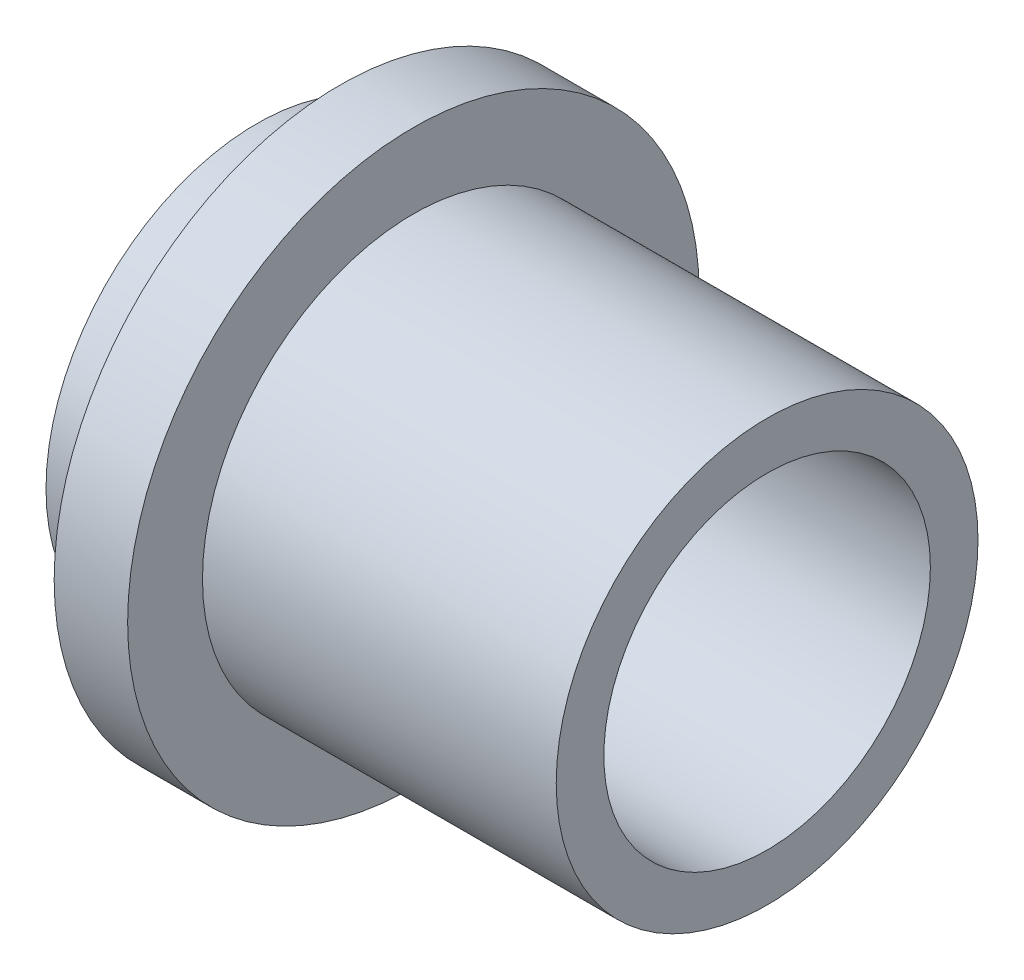
ISO-10303-21;
HEADER;
FILE_DESCRIPTION(('STEP AP214'),'2;1');
FILE_NAME('part.step','',(''),(''),'','','');
FILE_SCHEMA(('AUTOMOTIVE_DESIGN { 1 0 10303 214 1 1 1 1 }'));
ENDSEC;
DATA;
#1=APPLICATION_CONTEXT('core data for automotive mechanical design processes');
#2=APPLICATION_PROTOCOL_DEFINITION('international standard','automotive_design',2000,#1);
#3=PRODUCT_CONTEXT('',#1,'mechanical');
#4=PRODUCT('Part','Part','',(#3));
#5=PRODUCT_RELATED_PRODUCT_CATEGORY('part','',(#4));
#6=PRODUCT_DEFINITION_FORMATION('','',#4);
#7=PRODUCT_DEFINITION_CONTEXT('part definition',#1,'design');
#8=PRODUCT_DEFINITION('design','',#6,#7);
#9=PRODUCT_DEFINITION_SHAPE('','',#8);
#10=(LENGTH_UNIT() NAMED_UNIT(*) SI_UNIT(.MILLI.,.METRE.));
#11=(NAMED_UNIT(*) PLANE_ANGLE_UNIT() SI_UNIT($,.RADIAN.));
#12=(NAMED_UNIT(*) SI_UNIT($,.STERADIAN.) SOLID_ANGLE_UNIT());
#13=UNCERTAINTY_MEASURE_WITH_UNIT(LENGTH_MEASURE(1.E-05),#10,'distance_accuracy_value','');
#14=(GEOMETRIC_REPRESENTATION_CONTEXT(3) GLOBAL_UNCERTAINTY_ASSIGNED_CONTEXT((#13)) GLOBAL_UNIT_ASSIGNED_CONTEXT((#10,
#11,#12)) REPRESENTATION_CONTEXT('',''));
#15=CARTESIAN_POINT('',(0.,0.,0.));
#16=DIRECTION('',(0.,0.,1.));
#17=DIRECTION('',(1.,0.,0.));
#18=AXIS2_PLACEMENT_3D('',#15,#16,#17);
#19=CARTESIAN_POINT('',(9.525,3.937,0.));
#20=DIRECTION('',(-1.,0.,0.));
#21=DIRECTION('',(0.,0.,1.));
#22=AXIS2_PLACEMENT_3D('',#19,#20,#21);
#23=PLANE('',#22);
#24=CARTESIAN_POINT('',(9.525,0.,0.));
#25=DIRECTION('',(-1.,0.,0.));
#26=DIRECTION('',(0.,0.,1.));
#27=AXIS2_PLACEMENT_3D('',#24,#25,#26);
#28=CIRCLE('',#27,3.937);
#29=CARTESIAN_POINT('',(9.525,0.,3.937));
#30=VERTEX_POINT('',#29);
#31=EDGE_CURVE('E82',#30,#30,#28,.T.);
#32=ORIENTED_EDGE('',*,*,#31,.F.);
#33=EDGE_LOOP('',(#32));
#34=FACE_BOUND('',#33,.T.);
#35=CARTESIAN_POINT('',(9.525,0.,0.));
#36=DIRECTION('',(1.,0.,0.));
#37=DIRECTION('',(0.,0.,-1.));
#38=AXIS2_PLACEMENT_3D('',#35,#36,#37);
#39=CIRCLE('',#38,3.048);
#40=CARTESIAN_POINT('',(9.525,0.,-3.048));
#41=VERTEX_POINT('',#40);
#42=EDGE_CURVE('E90',#41,#41,#39,.T.);
#43=ORIENTED_EDGE('',*,*,#42,.F.);
#44=EDGE_LOOP('',(#43));
#45=FACE_BOUND('',#44,.T.);
#46=ADVANCED_FACE('F50',(#34,#45),#23,.F.);
#47=CARTESIAN_POINT('',(0.,0.,0.));
#48=DIRECTION('',(1.,0.,0.));
#49=DIRECTION('',(0.,0.,-1.));
#50=AXIS2_PLACEMENT_3D('',#47,#48,#49);
#51=PLANE('',#50);
#52=CARTESIAN_POINT('',(0.,0.,0.));
#53=DIRECTION('',(1.,0.,0.));
#54=DIRECTION('',(0.,0.,-1.));
#55=AXIS2_PLACEMENT_3D('',#52,#53,#54);
#56=CIRCLE('',#55,3.048);
#57=CARTESIAN_POINT('',(0.,0.,-3.048));
#58=VERTEX_POINT('',#57);
#59=EDGE_CURVE('E86',#58,#58,#56,.T.);
#60=ORIENTED_EDGE('',*,*,#59,.T.);
#61=EDGE_LOOP('',(#60));
#62=FACE_BOUND('',#61,.T.);
#63=CARTESIAN_POINT('',(0.,0.,0.));
#64=DIRECTION('',(-1.,0.,0.));
#65=DIRECTION('',(0.,0.,1.));
#66=AXIS2_PLACEMENT_3D('',#63,#64,#65);
#67=CIRCLE('',#66,3.937);
#68=CARTESIAN_POINT('',(0.,0.,3.937));
#69=VERTEX_POINT('',#68);
#70=EDGE_CURVE('E12',#69,#69,#67,.T.);
#71=ORIENTED_EDGE('',*,*,#70,.T.);
#72=EDGE_LOOP('',(#71));
#73=FACE_BOUND('',#72,.T.);
#74=ADVANCED_FACE('F52',(#62,#73),#51,.F.);
#75=CARTESIAN_POINT('',(-1.98792847682119,0.,0.));
#76=DIRECTION('',(-1.,0.,0.));
#77=DIRECTION('',(0.,0.,1.));
#78=AXIS2_PLACEMENT_3D('',#75,#76,#77);
#79=CYLINDRICAL_SURFACE('',#78,3.937);
#80=ORIENTED_EDGE('',*,*,#70,.F.);
#81=EDGE_LOOP('',(#80));
#82=FACE_BOUND('',#81,.T.);
#83=CARTESIAN_POINT('',(0.635,0.,0.));
#84=DIRECTION('',(-1.,0.,0.));
#85=DIRECTION('',(0.,0.,1.));
#86=AXIS2_PLACEMENT_3D('',#83,#84,#85);
#87=CIRCLE('',#86,3.937);
#88=CARTESIAN_POINT('',(0.635,0.,3.937));
#89=VERTEX_POINT('',#88);
#90=EDGE_CURVE('E58',#89,#89,#87,.T.);
#91=ORIENTED_EDGE('',*,*,#90,.T.);
#92=EDGE_LOOP('',(#91));
#93=FACE_BOUND('',#92,.T.);
#94=ADVANCED_FACE('F103',(#82,#93),#79,.T.);
#95=CARTESIAN_POINT('',(1.5494,0.,0.));
#96=DIRECTION('',(1.,0.,0.));
#97=DIRECTION('',(0.,0.,-1.));
#98=AXIS2_PLACEMENT_3D('',#95,#96,#97);
#99=CONICAL_SURFACE('',#98,4.8514,0.78539816339745);
#100=ORIENTED_EDGE('',*,*,#90,.F.);
#101=EDGE_LOOP('',(#100));
#102=FACE_BOUND('',#101,.T.);
#103=CARTESIAN_POINT('',(1.5494,0.,0.));
#104=DIRECTION('',(-1.,0.,0.));
#105=DIRECTION('',(0.,0.,1.));
#106=AXIS2_PLACEMENT_3D('',#103,#104,#105);
#107=CIRCLE('',#106,4.8514);
#108=CARTESIAN_POINT('',(1.5494,0.,4.8514));
#109=VERTEX_POINT('',#108);
#110=EDGE_CURVE('E63',#109,#109,#107,.T.);
#111=ORIENTED_EDGE('',*,*,#110,.T.);
#112=EDGE_LOOP('',(#111));
#113=FACE_BOUND('',#112,.T.);
#114=ADVANCED_FACE('F123',(#102,#113),#99,.T.);
#115=CARTESIAN_POINT('',(1.5494,4.8514,0.));
#116=DIRECTION('',(1.,0.,0.));
#117=DIRECTION('',(0.,0.,-1.));
#118=AXIS2_PLACEMENT_3D('',#115,#116,#117);
#119=PLANE('',#118);
#120=ORIENTED_EDGE('',*,*,#110,.F.);
#121=EDGE_LOOP('',(#120));
#122=FACE_BOUND('',#121,.T.);
#123=CARTESIAN_POINT('',(1.5494,0.,0.));
#124=DIRECTION('',(-1.,0.,0.));
#125=DIRECTION('',(0.,0.,1.));
#126=AXIS2_PLACEMENT_3D('',#123,#124,#125);
#127=CIRCLE('',#126,5.334);
#128=CARTESIAN_POINT('',(1.5494,0.,5.334));
#129=VERTEX_POINT('',#128);
#130=EDGE_CURVE('E68',#129,#129,#127,.T.);
#131=ORIENTED_EDGE('',*,*,#130,.T.);
#132=EDGE_LOOP('',(#131));
#133=FACE_BOUND('',#132,.T.);
#134=ADVANCED_FACE('F119',(#122,#133),#119,.F.);
#135=CARTESIAN_POINT('',(-1.98792847682119,0.,0.));
#136=DIRECTION('',(-1.,0.,0.));
#137=DIRECTION('',(0.,0.,1.));
#138=AXIS2_PLACEMENT_3D('',#135,#136,#137);
#139=CYLINDRICAL_SURFACE('',#138,5.334);
#140=ORIENTED_EDGE('',*,*,#130,.F.);
#141=EDGE_LOOP('',(#140));
#142=FACE_BOUND('',#141,.T.);
#143=CARTESIAN_POINT('',(2.921,0.,0.));
#144=DIRECTION('',(-1.,0.,0.));
#145=DIRECTION('',(0.,0.,1.));
#146=AXIS2_PLACEMENT_3D('',#143,#144,#145);
#147=CIRCLE('',#146,5.334);
#148=CARTESIAN_POINT('',(2.921,0.,5.334));
#149=VERTEX_POINT('',#148);
#150=EDGE_CURVE('E74',#149,#149,#147,.T.);
#151=ORIENTED_EDGE('',*,*,#150,.T.);
#152=EDGE_LOOP('',(#151));
#153=FACE_BOUND('',#152,.T.);
#154=ADVANCED_FACE('F115',(#142,#153),#139,.T.);
#155=CARTESIAN_POINT('',(2.921,5.334,0.));
#156=DIRECTION('',(-1.,0.,0.));
#157=DIRECTION('',(0.,0.,1.));
#158=AXIS2_PLACEMENT_3D('',#155,#156,#157);
#159=PLANE('',#158);
#160=ORIENTED_EDGE('',*,*,#150,.F.);
#161=EDGE_LOOP('',(#160));
#162=FACE_BOUND('',#161,.T.);
#163=CARTESIAN_POINT('',(2.921,0.,0.));
#164=DIRECTION('',(-1.,0.,0.));
#165=DIRECTION('',(0.,0.,1.));
#166=AXIS2_PLACEMENT_3D('',#163,#164,#165);
#167=CIRCLE('',#166,3.937);
#168=CARTESIAN_POINT('',(2.921,0.,3.937));
#169=VERTEX_POINT('',#168);
#170=EDGE_CURVE('E78',#169,#169,#167,.T.);
#171=ORIENTED_EDGE('',*,*,#170,.T.);
#172=EDGE_LOOP('',(#171));
#173=FACE_BOUND('',#172,.T.);
#174=ADVANCED_FACE('F111',(#162,#173),#159,.F.);
#175=CARTESIAN_POINT('',(-1.98792847682119,0.,0.));
#176=DIRECTION('',(-1.,0.,0.));
#177=DIRECTION('',(0.,0.,1.));
#178=AXIS2_PLACEMENT_3D('',#175,#176,#177);
#179=CYLINDRICAL_SURFACE('',#178,3.937);
#180=ORIENTED_EDGE('',*,*,#170,.F.);
#181=EDGE_LOOP('',(#180));
#182=FACE_BOUND('',#181,.T.);
#183=ORIENTED_EDGE('',*,*,#31,.T.);
#184=EDGE_LOOP('',(#183));
#185=FACE_BOUND('',#184,.T.);
#186=ADVANCED_FACE('F108',(#182,#185),#179,.T.);
#187=CARTESIAN_POINT('',(9.525,0.,0.));
#188=DIRECTION('',(1.,0.,0.));
#189=DIRECTION('',(0.,0.,-1.));
#190=AXIS2_PLACEMENT_3D('',#187,#188,#189);
#191=CYLINDRICAL_SURFACE('',#190,3.048);
#192=ORIENTED_EDGE('',*,*,#59,.F.);
#193=EDGE_LOOP('',(#192));
#194=FACE_BOUND('',#193,.T.);
#195=ORIENTED_EDGE('',*,*,#42,.T.);
#196=EDGE_LOOP('',(#195));
#197=FACE_BOUND('',#196,.T.);
#198=ADVANCED_FACE('F95',(#194,#197),#191,.F.);
#199=CLOSED_SHELL('',(#46,#74,#94,#114,#134,#154,#174,#186,#198));
#200=MANIFOLD_SOLID_BREP('B2',#199);
#201=ADVANCED_BREP_SHAPE_REPRESENTATION('',(#18,#200),#14);
#202=SHAPE_DEFINITION_REPRESENTATION(#9,#201);
ENDSEC;
END-ISO-10303-21;
